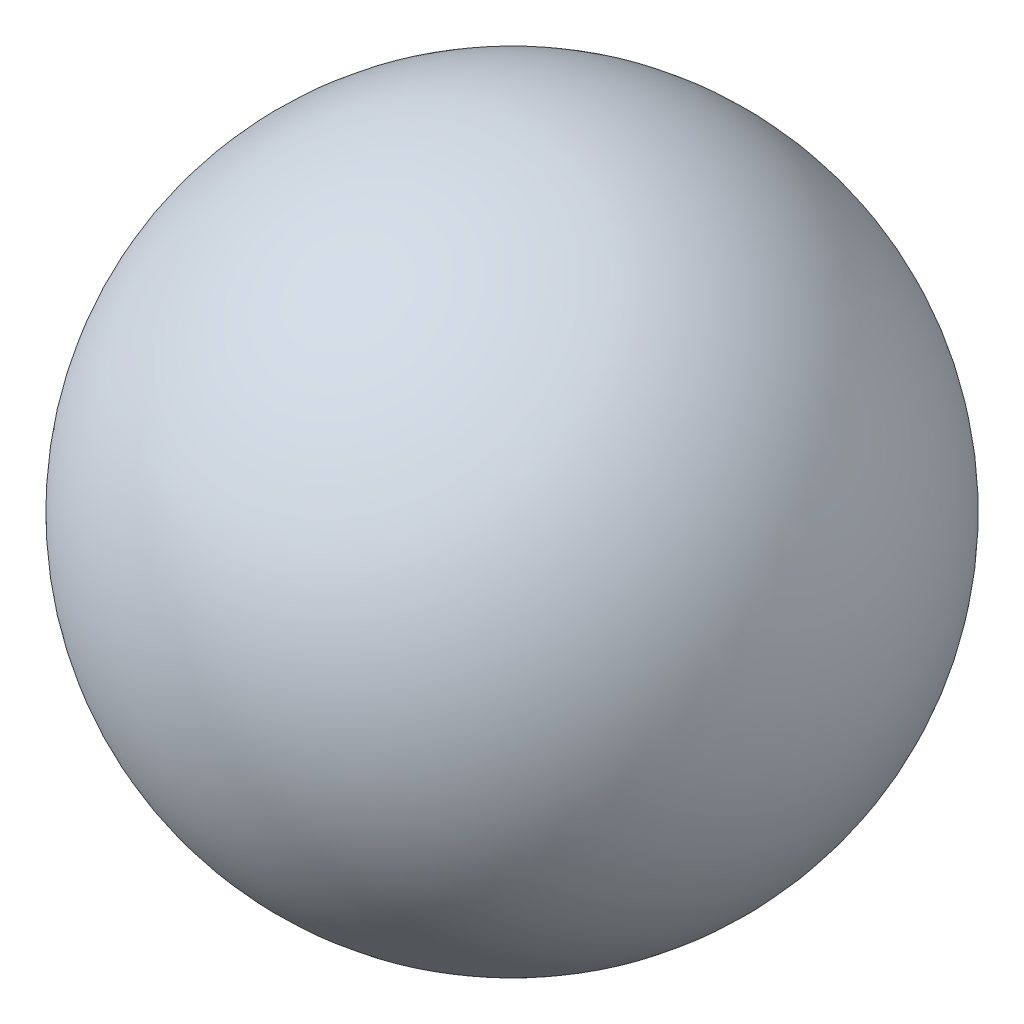
ISO-10303-21;
HEADER;
FILE_DESCRIPTION(('STEP AP214'),'2;1');
FILE_NAME('part.step','',(''),(''),'','','');
FILE_SCHEMA(('AUTOMOTIVE_DESIGN { 1 0 10303 214 1 1 1 1 }'));
ENDSEC;
DATA;
#1=APPLICATION_CONTEXT('core data for automotive mechanical design processes');
#2=APPLICATION_PROTOCOL_DEFINITION('international standard','automotive_design',2000,#1);
#3=PRODUCT_CONTEXT('',#1,'mechanical');
#4=PRODUCT('Part','Part','',(#3));
#5=PRODUCT_RELATED_PRODUCT_CATEGORY('part','',(#4));
#6=PRODUCT_DEFINITION_FORMATION('','',#4);
#7=PRODUCT_DEFINITION_CONTEXT('part definition',#1,'design');
#8=PRODUCT_DEFINITION('design','',#6,#7);
#9=PRODUCT_DEFINITION_SHAPE('','',#8);
#10=(LENGTH_UNIT() NAMED_UNIT(*) SI_UNIT(.MILLI.,.METRE.));
#11=(NAMED_UNIT(*) PLANE_ANGLE_UNIT() SI_UNIT($,.RADIAN.));
#12=(NAMED_UNIT(*) SI_UNIT($,.STERADIAN.) SOLID_ANGLE_UNIT());
#13=UNCERTAINTY_MEASURE_WITH_UNIT(LENGTH_MEASURE(1.E-05),#10,'distance_accuracy_value','');
#14=(GEOMETRIC_REPRESENTATION_CONTEXT(3) GLOBAL_UNCERTAINTY_ASSIGNED_CONTEXT((#13)) GLOBAL_UNIT_ASSIGNED_CONTEXT((#10,
#11,#12)) REPRESENTATION_CONTEXT('',''));
#15=CARTESIAN_POINT('',(0.,0.,0.));
#16=DIRECTION('',(0.,0.,1.));
#17=DIRECTION('',(1.,0.,0.));
#18=AXIS2_PLACEMENT_3D('',#15,#16,#17);
#19=CARTESIAN_POINT('',(0.,0.,0.));
#20=DIRECTION('',(0.,1.,0.));
#21=DIRECTION('',(1.,0.,0.));
#22=AXIS2_PLACEMENT_3D('',#19,#20,#21);
#23=SPHERICAL_SURFACE('',#22,11.25);
#24=CARTESIAN_POINT('',(0.,11.25,0.));
#25=VERTEX_POINT('',#24);
#26=VERTEX_LOOP('',#25);
#27=FACE_BOUND('',#26,.T.);
#28=ADVANCED_FACE('F29',(#27),#23,.T.);
#29=CLOSED_SHELL('',(#28));
#30=MANIFOLD_SOLID_BREP('B2',#29);
#31=ADVANCED_BREP_SHAPE_REPRESENTATION('',(#18,#30),#14);
#32=SHAPE_DEFINITION_REPRESENTATION(#9,#31);
ENDSEC;
END-ISO-10303-21;
